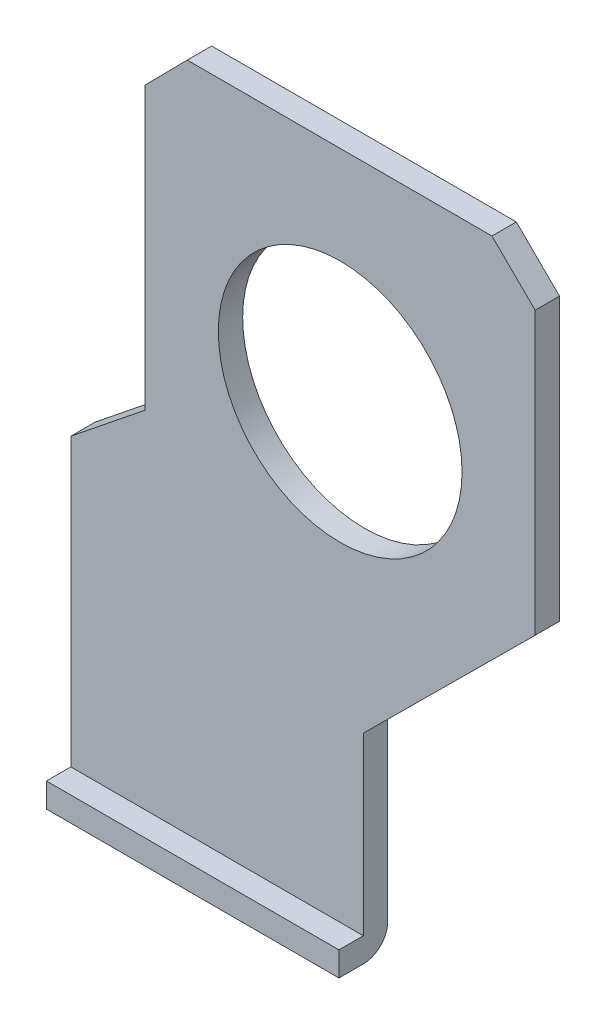
ISO-10303-21;
HEADER;
FILE_DESCRIPTION(('STEP AP214'),'2;1');
FILE_NAME('part.step','',(''),(''),'','','');
FILE_SCHEMA(('AUTOMOTIVE_DESIGN { 1 0 10303 214 1 1 1 1 }'));
ENDSEC;
DATA;
#1=APPLICATION_CONTEXT('core data for automotive mechanical design processes');
#2=APPLICATION_PROTOCOL_DEFINITION('international standard','automotive_design',2000,#1);
#3=PRODUCT_CONTEXT('',#1,'mechanical');
#4=PRODUCT('Part','Part','',(#3));
#5=PRODUCT_RELATED_PRODUCT_CATEGORY('part','',(#4));
#6=PRODUCT_DEFINITION_FORMATION('','',#4);
#7=PRODUCT_DEFINITION_CONTEXT('part definition',#1,'design');
#8=PRODUCT_DEFINITION('design','',#6,#7);
#9=PRODUCT_DEFINITION_SHAPE('','',#8);
#10=(LENGTH_UNIT() NAMED_UNIT(*) SI_UNIT(.MILLI.,.METRE.));
#11=(NAMED_UNIT(*) PLANE_ANGLE_UNIT() SI_UNIT($,.RADIAN.));
#12=(NAMED_UNIT(*) SI_UNIT($,.STERADIAN.) SOLID_ANGLE_UNIT());
#13=UNCERTAINTY_MEASURE_WITH_UNIT(LENGTH_MEASURE(1.E-05),#10,'distance_accuracy_value','');
#14=(GEOMETRIC_REPRESENTATION_CONTEXT(3) GLOBAL_UNCERTAINTY_ASSIGNED_CONTEXT((#13)) GLOBAL_UNIT_ASSIGNED_CONTEXT((#10,
#11,#12)) REPRESENTATION_CONTEXT('',''));
#15=CARTESIAN_POINT('',(0.,0.,0.));
#16=DIRECTION('',(0.,0.,1.));
#17=DIRECTION('',(1.,0.,0.));
#18=AXIS2_PLACEMENT_3D('',#15,#16,#17);
#19=CARTESIAN_POINT('',(1.025,1.55,0.2));
#20=DIRECTION('',(0.,1.,0.));
#21=DIRECTION('',(0.,0.,1.));
#22=AXIS2_PLACEMENT_3D('',#19,#20,#21);
#23=PLANE('',#22);
#24=DIRECTION('',(-1.,0.,0.));
#25=VECTOR('',#24,1.);
#26=CARTESIAN_POINT('',(1.025,1.55,0.1));
#27=LINE('',#26,#25);
#28=CARTESIAN_POINT('',(2.225,1.55,0.1));
#29=VERTEX_POINT('',#28);
#30=CARTESIAN_POINT('',(1.025,1.55,0.1));
#31=VERTEX_POINT('',#30);
#32=EDGE_CURVE('E118',#29,#31,#27,.T.);
#33=ORIENTED_EDGE('',*,*,#32,.F.);
#34=DIRECTION('',(0.,0.,-1.));
#35=VECTOR('',#34,1.);
#36=CARTESIAN_POINT('',(2.225,1.55,0.));
#37=LINE('',#36,#35);
#38=CARTESIAN_POINT('',(2.225,1.55,0.2));
#39=VERTEX_POINT('',#38);
#40=EDGE_CURVE('E185',#39,#29,#37,.T.);
#41=ORIENTED_EDGE('',*,*,#40,.F.);
#42=DIRECTION('',(1.,0.,0.));
#43=VECTOR('',#42,1.);
#44=CARTESIAN_POINT('',(2.225,1.55,0.2));
#45=LINE('',#44,#43);
#46=CARTESIAN_POINT('',(1.025,1.55,0.2));
#47=VERTEX_POINT('',#46);
#48=EDGE_CURVE('E129',#47,#39,#45,.T.);
#49=ORIENTED_EDGE('',*,*,#48,.F.);
#50=DIRECTION('',(0.,0.,1.));
#51=VECTOR('',#50,1.);
#52=CARTESIAN_POINT('',(1.025,1.55,0.));
#53=LINE('',#52,#51);
#54=EDGE_CURVE('E107',#47,#31,#53,.F.);
#55=ORIENTED_EDGE('',*,*,#54,.T.);
#56=EDGE_LOOP('',(#33,#41,#49,#55));
#57=FACE_BOUND('',#56,.T.);
#58=ADVANCED_FACE('F16',(#57),#23,.F.);
#59=CARTESIAN_POINT('',(1.025,1.65,0.1));
#60=DIRECTION('',(-1.,0.,0.));
#61=DIRECTION('',(0.,0.,1.));
#62=AXIS2_PLACEMENT_3D('',#59,#60,#61);
#63=CYLINDRICAL_SURFACE('',#62,0.1);
#64=CARTESIAN_POINT('',(2.225,1.65,0.1));
#65=DIRECTION('',(-1.,0.,0.));
#66=DIRECTION('',(0.,0.,1.));
#67=AXIS2_PLACEMENT_3D('',#64,#65,#66);
#68=CIRCLE('',#67,0.1);
#69=CARTESIAN_POINT('',(2.225,1.65,0.));
#70=VERTEX_POINT('',#69);
#71=EDGE_CURVE('E191',#29,#70,#68,.F.);
#72=ORIENTED_EDGE('',*,*,#71,.F.);
#73=ORIENTED_EDGE('',*,*,#32,.T.);
#74=CARTESIAN_POINT('',(1.025,1.65,0.1));
#75=DIRECTION('',(-1.,0.,0.));
#76=DIRECTION('',(0.,0.,1.));
#77=AXIS2_PLACEMENT_3D('',#74,#75,#76);
#78=CIRCLE('',#77,0.1);
#79=CARTESIAN_POINT('',(1.025,1.65,0.));
#80=VERTEX_POINT('',#79);
#81=EDGE_CURVE('E112',#31,#80,#78,.F.);
#82=ORIENTED_EDGE('',*,*,#81,.T.);
#83=DIRECTION('',(1.,0.,0.));
#84=VECTOR('',#83,1.);
#85=CARTESIAN_POINT('',(-2.43,1.65,0.));
#86=LINE('',#85,#84);
#87=EDGE_CURVE('E116',#80,#70,#86,.T.);
#88=ORIENTED_EDGE('',*,*,#87,.T.);
#89=EDGE_LOOP('',(#72,#73,#82,#88));
#90=FACE_BOUND('',#89,.T.);
#91=ADVANCED_FACE('F115',(#90),#63,.T.);
#92=CARTESIAN_POINT('',(2.225,1.55,0.2));
#93=DIRECTION('',(0.,0.,1.));
#94=DIRECTION('',(1.,0.,0.));
#95=AXIS2_PLACEMENT_3D('',#92,#93,#94);
#96=PLANE('',#95);
#97=DIRECTION('',(1.,0.,0.));
#98=VECTOR('',#97,1.);
#99=CARTESIAN_POINT('',(2.225,1.65,0.2));
#100=LINE('',#99,#98);
#101=CARTESIAN_POINT('',(2.225,1.65,0.2));
#102=VERTEX_POINT('',#101);
#103=CARTESIAN_POINT('',(1.025,1.65,0.2));
#104=VERTEX_POINT('',#103);
#105=EDGE_CURVE('E135',#102,#104,#100,.F.);
#106=ORIENTED_EDGE('',*,*,#105,.T.);
#107=DIRECTION('',(0.,1.,0.));
#108=VECTOR('',#107,1.);
#109=CARTESIAN_POINT('',(1.025,3.07,0.2));
#110=LINE('',#109,#108);
#111=EDGE_CURVE('E146',#104,#47,#110,.F.);
#112=ORIENTED_EDGE('',*,*,#111,.T.);
#113=ORIENTED_EDGE('',*,*,#48,.T.);
#114=DIRECTION('',(0.,1.,0.));
#115=VECTOR('',#114,1.);
#116=CARTESIAN_POINT('',(2.225,1.05,0.2));
#117=LINE('',#116,#115);
#118=EDGE_CURVE('E157',#102,#39,#117,.F.);
#119=ORIENTED_EDGE('',*,*,#118,.F.);
#120=EDGE_LOOP('',(#106,#112,#113,#119));
#121=FACE_BOUND('',#120,.T.);
#122=ADVANCED_FACE('F282',(#121),#96,.T.);
#123=CARTESIAN_POINT('',(-2.43,-1.7,0.));
#124=DIRECTION('',(0.,0.,1.));
#125=DIRECTION('',(1.,0.,0.));
#126=AXIS2_PLACEMENT_3D('',#123,#124,#125);
#127=PLANE('',#126);
#128=CARTESIAN_POINT('',(2.13,3.5,0.));
#129=DIRECTION('',(0.,0.,-1.));
#130=DIRECTION('',(-1.,0.,0.));
#131=AXIS2_PLACEMENT_3D('',#128,#129,#130);
#132=CIRCLE('',#131,0.5);
#133=CARTESIAN_POINT('',(1.63,3.5,0.));
#134=VERTEX_POINT('',#133);
#135=EDGE_CURVE('E19',#134,#134,#132,.F.);
#136=ORIENTED_EDGE('',*,*,#135,.T.);
#137=EDGE_LOOP('',(#136));
#138=FACE_BOUND('',#137,.T.);
#139=ORIENTED_EDGE('',*,*,#87,.F.);
#140=DIRECTION('',(0.,1.,0.));
#141=VECTOR('',#140,1.);
#142=CARTESIAN_POINT('',(1.025,3.07,0.));
#143=LINE('',#142,#141);
#144=CARTESIAN_POINT('',(1.025,2.825,0.));
#145=VERTEX_POINT('',#144);
#146=EDGE_CURVE('E121',#80,#145,#143,.T.);
#147=ORIENTED_EDGE('',*,*,#146,.T.);
#148=DIRECTION('',(-0.779620360119656,-0.626252420423984,0.));
#149=VECTOR('',#148,1.);
#150=CARTESIAN_POINT('',(1.33,3.07,0.));
#151=LINE('',#150,#149);
#152=CARTESIAN_POINT('',(1.33,3.07,0.));
#153=VERTEX_POINT('',#152);
#154=EDGE_CURVE('E172',#153,#145,#151,.T.);
#155=ORIENTED_EDGE('',*,*,#154,.F.);
#156=DIRECTION('',(0.,1.,0.));
#157=VECTOR('',#156,1.);
#158=CARTESIAN_POINT('',(1.33,4.4,0.));
#159=LINE('',#158,#157);
#160=CARTESIAN_POINT('',(1.33,4.225,0.));
#161=VERTEX_POINT('',#160);
#162=EDGE_CURVE('E217',#153,#161,#159,.T.);
#163=ORIENTED_EDGE('',*,*,#162,.T.);
#164=DIRECTION('',(0.702345280394573,0.711836432832339,0.));
#165=VECTOR('',#164,1.);
#166=CARTESIAN_POINT('',(1.33,4.225,0.));
#167=LINE('',#166,#165);
#168=CARTESIAN_POINT('',(1.50266666666667,4.4,0.));
#169=VERTEX_POINT('',#168);
#170=EDGE_CURVE('E213',#161,#169,#167,.T.);
#171=ORIENTED_EDGE('',*,*,#170,.T.);
#172=DIRECTION('',(1.,0.,0.));
#173=VECTOR('',#172,1.);
#174=CARTESIAN_POINT('',(1.50266666666667,4.4,0.));
#175=LINE('',#174,#173);
#176=CARTESIAN_POINT('',(2.75266666666667,4.4,0.));
#177=VERTEX_POINT('',#176);
#178=EDGE_CURVE('E209',#169,#177,#175,.T.);
#179=ORIENTED_EDGE('',*,*,#178,.T.);
#180=DIRECTION('',(0.711773999328799,-0.702408551969213,0.));
#181=VECTOR('',#180,1.);
#182=CARTESIAN_POINT('',(2.55,4.6,0.));
#183=LINE('',#182,#181);
#184=CARTESIAN_POINT('',(2.93,4.225,0.));
#185=VERTEX_POINT('',#184);
#186=EDGE_CURVE('E206',#177,#185,#183,.T.);
#187=ORIENTED_EDGE('',*,*,#186,.T.);
#188=DIRECTION('',(0.,1.,0.));
#189=VECTOR('',#188,1.);
#190=CARTESIAN_POINT('',(2.93,-1.7,0.));
#191=LINE('',#190,#189);
#192=CARTESIAN_POINT('',(2.93,3.07,0.));
#193=VERTEX_POINT('',#192);
#194=EDGE_CURVE('E201',#185,#193,#191,.F.);
#195=ORIENTED_EDGE('',*,*,#194,.T.);
#196=DIRECTION('',(0.709618681964093,0.70458592535442,0.));
#197=VECTOR('',#196,1.);
#198=CARTESIAN_POINT('',(2.225,2.37,0.));
#199=LINE('',#198,#197);
#200=CARTESIAN_POINT('',(2.225,2.37,0.));
#201=VERTEX_POINT('',#200);
#202=EDGE_CURVE('E149',#201,#193,#199,.T.);
#203=ORIENTED_EDGE('',*,*,#202,.F.);
#204=DIRECTION('',(0.,1.,0.));
#205=VECTOR('',#204,1.);
#206=CARTESIAN_POINT('',(2.225,1.05,0.));
#207=LINE('',#206,#205);
#208=EDGE_CURVE('E127',#70,#201,#207,.T.);
#209=ORIENTED_EDGE('',*,*,#208,.F.);
#210=EDGE_LOOP('',(#139,#147,#155,#163,#171,#179,#187,#195,#203,#209));
#211=FACE_BOUND('',#210,.T.);
#212=ADVANCED_FACE('F123',(#138,#211),#127,.F.);
#213=CARTESIAN_POINT('',(2.13,3.5,-3.075));
#214=DIRECTION('',(0.,0.,-1.));
#215=DIRECTION('',(-1.,0.,0.));
#216=AXIS2_PLACEMENT_3D('',#213,#214,#215);
#217=CYLINDRICAL_SURFACE('',#216,0.5);
#218=ORIENTED_EDGE('',*,*,#135,.F.);
#219=EDGE_LOOP('',(#218));
#220=FACE_BOUND('',#219,.T.);
#221=CARTESIAN_POINT('',(2.13,3.5,0.0999999999999998));
#222=DIRECTION('',(0.,0.,-1.));
#223=DIRECTION('',(-1.,0.,0.));
#224=AXIS2_PLACEMENT_3D('',#221,#222,#223);
#225=CIRCLE('',#224,0.5);
#226=CARTESIAN_POINT('',(1.63,3.5,0.0999999999999998));
#227=VERTEX_POINT('',#226);
#228=EDGE_CURVE('E171',#227,#227,#225,.T.);
#229=ORIENTED_EDGE('',*,*,#228,.F.);
#230=EDGE_LOOP('',(#229));
#231=FACE_BOUND('',#230,.T.);
#232=ADVANCED_FACE('F315',(#220,#231),#217,.F.);
#233=CARTESIAN_POINT('',(1.025,3.07,0.));
#234=DIRECTION('',(1.,0.,0.));
#235=DIRECTION('',(0.,1.,0.));
#236=AXIS2_PLACEMENT_3D('',#233,#234,#235);
#237=PLANE('',#236);
#238=ORIENTED_EDGE('',*,*,#81,.F.);
#239=ORIENTED_EDGE('',*,*,#54,.F.);
#240=ORIENTED_EDGE('',*,*,#111,.F.);
#241=DIRECTION('',(0.,0.,-1.));
#242=VECTOR('',#241,1.);
#243=CARTESIAN_POINT('',(1.025,1.65,0.2));
#244=LINE('',#243,#242);
#245=CARTESIAN_POINT('',(1.025,1.65,0.1));
#246=VERTEX_POINT('',#245);
#247=EDGE_CURVE('E137',#104,#246,#244,.T.);
#248=ORIENTED_EDGE('',*,*,#247,.T.);
#249=DIRECTION('',(0.,1.,0.));
#250=VECTOR('',#249,1.);
#251=CARTESIAN_POINT('',(1.025,-1.7,0.1));
#252=LINE('',#251,#250);
#253=CARTESIAN_POINT('',(1.025,2.825,0.1));
#254=VERTEX_POINT('',#253);
#255=EDGE_CURVE('E190',#254,#246,#252,.F.);
#256=ORIENTED_EDGE('',*,*,#255,.F.);
#257=DIRECTION('',(0.,0.,1.));
#258=VECTOR('',#257,1.);
#259=CARTESIAN_POINT('',(1.025,2.825,0.));
#260=LINE('',#259,#258);
#261=EDGE_CURVE('E133',#145,#254,#260,.T.);
#262=ORIENTED_EDGE('',*,*,#261,.F.);
#263=ORIENTED_EDGE('',*,*,#146,.F.);
#264=EDGE_LOOP('',(#238,#239,#240,#248,#256,#262,#263));
#265=FACE_BOUND('',#264,.T.);
#266=ADVANCED_FACE('F131',(#265),#237,.F.);
#267=CARTESIAN_POINT('',(2.225,1.65,0.2));
#268=DIRECTION('',(0.,-1.,0.));
#269=DIRECTION('',(0.,0.,-1.));
#270=AXIS2_PLACEMENT_3D('',#267,#268,#269);
#271=PLANE('',#270);
#272=ORIENTED_EDGE('',*,*,#247,.F.);
#273=ORIENTED_EDGE('',*,*,#105,.F.);
#274=DIRECTION('',(0.,0.,-1.));
#275=VECTOR('',#274,1.);
#276=CARTESIAN_POINT('',(2.225,1.65,0.));
#277=LINE('',#276,#275);
#278=CARTESIAN_POINT('',(2.225,1.65,0.1));
#279=VERTEX_POINT('',#278);
#280=EDGE_CURVE('E167',#279,#102,#277,.F.);
#281=ORIENTED_EDGE('',*,*,#280,.F.);
#282=DIRECTION('',(1.,0.,0.));
#283=VECTOR('',#282,1.);
#284=CARTESIAN_POINT('',(-2.43,1.65,0.1));
#285=LINE('',#284,#283);
#286=EDGE_CURVE('E224',#246,#279,#285,.T.);
#287=ORIENTED_EDGE('',*,*,#286,.F.);
#288=EDGE_LOOP('',(#272,#273,#281,#287));
#289=FACE_BOUND('',#288,.T.);
#290=ADVANCED_FACE('F278',(#289),#271,.F.);
#291=CARTESIAN_POINT('',(2.225,1.05,0.));
#292=DIRECTION('',(1.,0.,0.));
#293=DIRECTION('',(0.,0.,-1.));
#294=AXIS2_PLACEMENT_3D('',#291,#292,#293);
#295=PLANE('',#294);
#296=ORIENTED_EDGE('',*,*,#280,.T.);
#297=ORIENTED_EDGE('',*,*,#118,.T.);
#298=ORIENTED_EDGE('',*,*,#40,.T.);
#299=ORIENTED_EDGE('',*,*,#71,.T.);
#300=ORIENTED_EDGE('',*,*,#208,.T.);
#301=DIRECTION('',(0.,0.,1.));
#302=VECTOR('',#301,1.);
#303=CARTESIAN_POINT('',(2.225,2.37,0.));
#304=LINE('',#303,#302);
#305=CARTESIAN_POINT('',(2.225,2.37,0.1));
#306=VERTEX_POINT('',#305);
#307=EDGE_CURVE('E152',#306,#201,#304,.F.);
#308=ORIENTED_EDGE('',*,*,#307,.F.);
#309=DIRECTION('',(0.,1.,0.));
#310=VECTOR('',#309,1.);
#311=CARTESIAN_POINT('',(2.225,-1.7,0.1));
#312=LINE('',#311,#310);
#313=EDGE_CURVE('E227',#279,#306,#312,.T.);
#314=ORIENTED_EDGE('',*,*,#313,.F.);
#315=EDGE_LOOP('',(#296,#297,#298,#299,#300,#308,#314));
#316=FACE_BOUND('',#315,.T.);
#317=ADVANCED_FACE('F274',(#316),#295,.T.);
#318=CARTESIAN_POINT('',(2.225,2.37,0.));
#319=DIRECTION('',(0.70458592535442,-0.709618681964093,0.));
#320=DIRECTION('',(0.709618681964093,0.70458592535442,0.));
#321=AXIS2_PLACEMENT_3D('',#318,#319,#320);
#322=PLANE('',#321);
#323=ORIENTED_EDGE('',*,*,#202,.T.);
#324=DIRECTION('',(0.,0.,1.));
#325=VECTOR('',#324,1.);
#326=CARTESIAN_POINT('',(2.93,3.07,0.1));
#327=LINE('',#326,#325);
#328=CARTESIAN_POINT('',(2.93,3.07,0.1));
#329=VERTEX_POINT('',#328);
#330=EDGE_CURVE('E151',#193,#329,#327,.T.);
#331=ORIENTED_EDGE('',*,*,#330,.T.);
#332=DIRECTION('',(0.709618681964093,0.704585925354419,0.));
#333=VECTOR('',#332,1.);
#334=CARTESIAN_POINT('',(2.225,2.37,0.1));
#335=LINE('',#334,#333);
#336=EDGE_CURVE('E230',#306,#329,#335,.T.);
#337=ORIENTED_EDGE('',*,*,#336,.F.);
#338=ORIENTED_EDGE('',*,*,#307,.T.);
#339=EDGE_LOOP('',(#323,#331,#337,#338));
#340=FACE_BOUND('',#339,.T.);
#341=ADVANCED_FACE('F272',(#340),#322,.T.);
#342=CARTESIAN_POINT('',(2.93,-1.7,0.1));
#343=DIRECTION('',(-1.,0.,0.));
#344=DIRECTION('',(0.,0.,1.));
#345=AXIS2_PLACEMENT_3D('',#342,#343,#344);
#346=PLANE('',#345);
#347=DIRECTION('',(0.,0.,1.));
#348=VECTOR('',#347,1.);
#349=CARTESIAN_POINT('',(2.93,4.225,0.));
#350=LINE('',#349,#348);
#351=CARTESIAN_POINT('',(2.93,4.225,0.1));
#352=VERTEX_POINT('',#351);
#353=EDGE_CURVE('E204',#185,#352,#350,.T.);
#354=ORIENTED_EDGE('',*,*,#353,.T.);
#355=DIRECTION('',(0.,1.,0.));
#356=VECTOR('',#355,1.);
#357=CARTESIAN_POINT('',(2.93,-1.7,0.1));
#358=LINE('',#357,#356);
#359=EDGE_CURVE('E233',#329,#352,#358,.T.);
#360=ORIENTED_EDGE('',*,*,#359,.F.);
#361=ORIENTED_EDGE('',*,*,#330,.F.);
#362=ORIENTED_EDGE('',*,*,#194,.F.);
#363=EDGE_LOOP('',(#354,#360,#361,#362));
#364=FACE_BOUND('',#363,.T.);
#365=ADVANCED_FACE('F269',(#364),#346,.F.);
#366=CARTESIAN_POINT('',(2.55,4.6,0.));
#367=DIRECTION('',(-0.702408551969213,-0.711773999328799,0.));
#368=DIRECTION('',(0.711773999328799,-0.702408551969213,0.));
#369=AXIS2_PLACEMENT_3D('',#366,#367,#368);
#370=PLANE('',#369);
#371=DIRECTION('',(0.,0.,-1.));
#372=VECTOR('',#371,1.);
#373=CARTESIAN_POINT('',(2.75266666666667,4.4,0.));
#374=LINE('',#373,#372);
#375=CARTESIAN_POINT('',(2.75266666666667,4.4,0.1));
#376=VERTEX_POINT('',#375);
#377=EDGE_CURVE('E211',#177,#376,#374,.F.);
#378=ORIENTED_EDGE('',*,*,#377,.T.);
#379=DIRECTION('',(-0.711773999328792,0.70240855196922,0.));
#380=VECTOR('',#379,1.);
#381=CARTESIAN_POINT('',(2.93,4.225,0.1));
#382=LINE('',#381,#380);
#383=EDGE_CURVE('E236',#352,#376,#382,.T.);
#384=ORIENTED_EDGE('',*,*,#383,.F.);
#385=ORIENTED_EDGE('',*,*,#353,.F.);
#386=ORIENTED_EDGE('',*,*,#186,.F.);
#387=EDGE_LOOP('',(#378,#384,#385,#386));
#388=FACE_BOUND('',#387,.T.);
#389=ADVANCED_FACE('F264',(#388),#370,.F.);
#390=CARTESIAN_POINT('',(1.50266666666667,4.4,0.));
#391=DIRECTION('',(0.,-1.,0.));
#392=DIRECTION('',(0.,0.,-1.));
#393=AXIS2_PLACEMENT_3D('',#390,#391,#392);
#394=PLANE('',#393);
#395=ORIENTED_EDGE('',*,*,#377,.F.);
#396=ORIENTED_EDGE('',*,*,#178,.F.);
#397=DIRECTION('',(0.,0.,1.));
#398=VECTOR('',#397,1.);
#399=CARTESIAN_POINT('',(1.50266666666667,4.4,0.));
#400=LINE('',#399,#398);
#401=CARTESIAN_POINT('',(1.50266666666667,4.4,0.1));
#402=VERTEX_POINT('',#401);
#403=EDGE_CURVE('E215',#169,#402,#400,.T.);
#404=ORIENTED_EDGE('',*,*,#403,.T.);
#405=DIRECTION('',(1.,0.,0.));
#406=VECTOR('',#405,1.);
#407=CARTESIAN_POINT('',(-2.43,4.4,0.1));
#408=LINE('',#407,#406);
#409=EDGE_CURVE('E239',#376,#402,#408,.F.);
#410=ORIENTED_EDGE('',*,*,#409,.F.);
#411=EDGE_LOOP('',(#395,#396,#404,#410));
#412=FACE_BOUND('',#411,.T.);
#413=ADVANCED_FACE('F260',(#412),#394,.F.);
#414=CARTESIAN_POINT('',(1.33,4.225,0.));
#415=DIRECTION('',(0.711836432832339,-0.702345280394573,0.));
#416=DIRECTION('',(0.702345280394573,0.711836432832339,0.));
#417=AXIS2_PLACEMENT_3D('',#414,#415,#416);
#418=PLANE('',#417);
#419=ORIENTED_EDGE('',*,*,#403,.F.);
#420=ORIENTED_EDGE('',*,*,#170,.F.);
#421=DIRECTION('',(0.,0.,1.));
#422=VECTOR('',#421,1.);
#423=CARTESIAN_POINT('',(1.33,4.225,0.));
#424=LINE('',#423,#422);
#425=CARTESIAN_POINT('',(1.33,4.225,0.1));
#426=VERTEX_POINT('',#425);
#427=EDGE_CURVE('E219',#161,#426,#424,.T.);
#428=ORIENTED_EDGE('',*,*,#427,.T.);
#429=DIRECTION('',(-0.702345280394579,-0.711836432832333,0.));
#430=VECTOR('',#429,1.);
#431=CARTESIAN_POINT('',(1.50266666666667,4.4,0.1));
#432=LINE('',#431,#430);
#433=EDGE_CURVE('E242',#402,#426,#432,.T.);
#434=ORIENTED_EDGE('',*,*,#433,.F.);
#435=EDGE_LOOP('',(#419,#420,#428,#434));
#436=FACE_BOUND('',#435,.T.);
#437=ADVANCED_FACE('F255',(#436),#418,.F.);
#438=CARTESIAN_POINT('',(1.33,4.4,0.));
#439=DIRECTION('',(1.,0.,0.));
#440=DIRECTION('',(0.,1.,0.));
#441=AXIS2_PLACEMENT_3D('',#438,#439,#440);
#442=PLANE('',#441);
#443=ORIENTED_EDGE('',*,*,#427,.F.);
#444=ORIENTED_EDGE('',*,*,#162,.F.);
#445=DIRECTION('',(0.,0.,1.));
#446=VECTOR('',#445,1.);
#447=CARTESIAN_POINT('',(1.33,3.07,0.));
#448=LINE('',#447,#446);
#449=CARTESIAN_POINT('',(1.33,3.07,0.1));
#450=VERTEX_POINT('',#449);
#451=EDGE_CURVE('E34',#450,#153,#448,.F.);
#452=ORIENTED_EDGE('',*,*,#451,.F.);
#453=DIRECTION('',(0.,1.,0.));
#454=VECTOR('',#453,1.);
#455=CARTESIAN_POINT('',(1.33,-1.7,0.1));
#456=LINE('',#455,#454);
#457=EDGE_CURVE('E25',#426,#450,#456,.F.);
#458=ORIENTED_EDGE('',*,*,#457,.F.);
#459=EDGE_LOOP('',(#443,#444,#452,#458));
#460=FACE_BOUND('',#459,.T.);
#461=ADVANCED_FACE('F251',(#460),#442,.F.);
#462=CARTESIAN_POINT('',(1.33,3.07,0.));
#463=DIRECTION('',(-0.626252420423984,0.779620360119656,0.));
#464=DIRECTION('',(-0.779620360119656,-0.626252420423984,0.));
#465=AXIS2_PLACEMENT_3D('',#462,#463,#464);
#466=PLANE('',#465);
#467=ORIENTED_EDGE('',*,*,#154,.T.);
#468=ORIENTED_EDGE('',*,*,#261,.T.);
#469=DIRECTION('',(-0.779620360119656,-0.626252420423984,0.));
#470=VECTOR('',#469,1.);
#471=CARTESIAN_POINT('',(1.33,3.07,0.1));
#472=LINE('',#471,#470);
#473=EDGE_CURVE('E11',#450,#254,#472,.T.);
#474=ORIENTED_EDGE('',*,*,#473,.F.);
#475=ORIENTED_EDGE('',*,*,#451,.T.);
#476=EDGE_LOOP('',(#467,#468,#474,#475));
#477=FACE_BOUND('',#476,.T.);
#478=ADVANCED_FACE('F289',(#477),#466,.T.);
#479=CARTESIAN_POINT('',(-2.43,-1.7,0.1));
#480=DIRECTION('',(0.,0.,1.));
#481=DIRECTION('',(1.,0.,0.));
#482=AXIS2_PLACEMENT_3D('',#479,#480,#481);
#483=PLANE('',#482);
#484=ORIENTED_EDGE('',*,*,#457,.T.);
#485=ORIENTED_EDGE('',*,*,#473,.T.);
#486=ORIENTED_EDGE('',*,*,#255,.T.);
#487=ORIENTED_EDGE('',*,*,#286,.T.);
#488=ORIENTED_EDGE('',*,*,#313,.T.);
#489=ORIENTED_EDGE('',*,*,#336,.T.);
#490=ORIENTED_EDGE('',*,*,#359,.T.);
#491=ORIENTED_EDGE('',*,*,#383,.T.);
#492=ORIENTED_EDGE('',*,*,#409,.T.);
#493=ORIENTED_EDGE('',*,*,#433,.T.);
#494=EDGE_LOOP('',(#484,#485,#486,#487,#488,#489,#490,#491,#492,#493));
#495=FACE_BOUND('',#494,.T.);
#496=ORIENTED_EDGE('',*,*,#228,.T.);
#497=EDGE_LOOP('',(#496));
#498=FACE_BOUND('',#497,.T.);
#499=ADVANCED_FACE('F247',(#495,#498),#483,.T.);
#500=CLOSED_SHELL('',(#58,#91,#122,#212,#232,#266,#290,#317,#341,#365,#389,#413,#437,#461,#478,#499));
#501=MANIFOLD_SOLID_BREP('B1',#500);
#502=ADVANCED_BREP_SHAPE_REPRESENTATION('',(#18,#501),#14);
#503=SHAPE_DEFINITION_REPRESENTATION(#9,#502);
ENDSEC;
END-ISO-10303-21;
